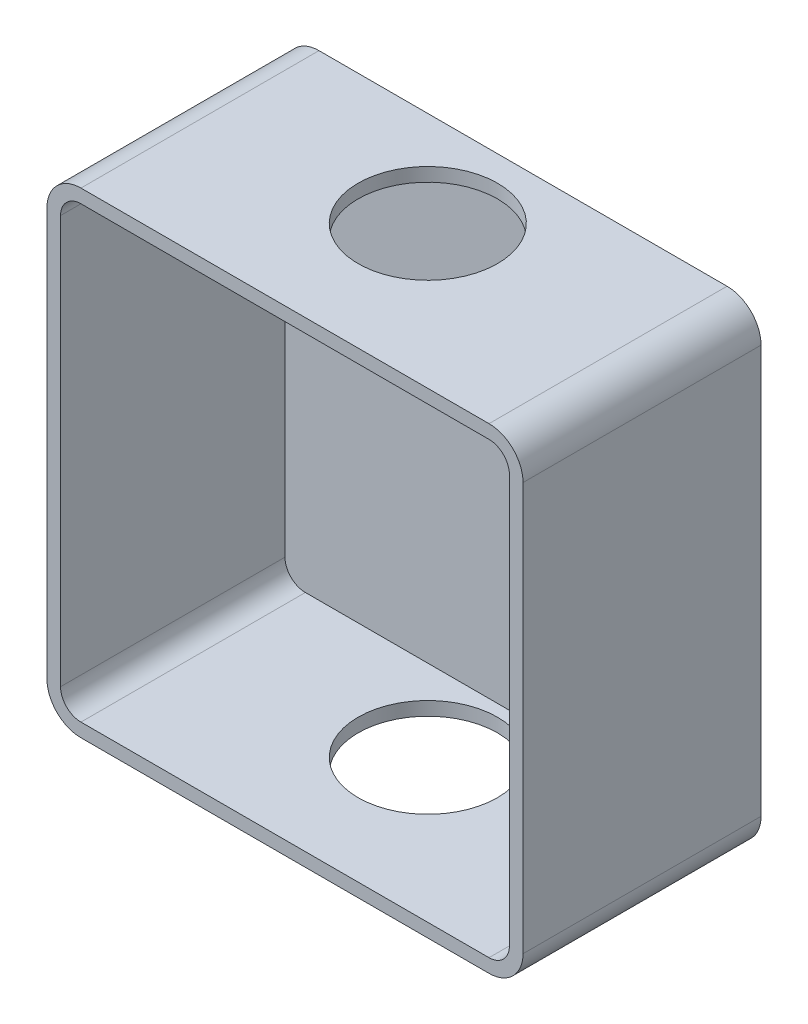
ISO-10303-21;
HEADER;
FILE_DESCRIPTION(('STEP AP214'),'2;1');
FILE_NAME('part.step','',(''),(''),'','','');
FILE_SCHEMA(('AUTOMOTIVE_DESIGN { 1 0 10303 214 1 1 1 1 }'));
ENDSEC;
DATA;
#1=APPLICATION_CONTEXT('core data for automotive mechanical design processes');
#2=APPLICATION_PROTOCOL_DEFINITION('international standard','automotive_design',2000,#1);
#3=PRODUCT_CONTEXT('',#1,'mechanical');
#4=PRODUCT('Part','Part','',(#3));
#5=PRODUCT_RELATED_PRODUCT_CATEGORY('part','',(#4));
#6=PRODUCT_DEFINITION_FORMATION('','',#4);
#7=PRODUCT_DEFINITION_CONTEXT('part definition',#1,'design');
#8=PRODUCT_DEFINITION('design','',#6,#7);
#9=PRODUCT_DEFINITION_SHAPE('','',#8);
#10=(LENGTH_UNIT() NAMED_UNIT(*) SI_UNIT(.MILLI.,.METRE.));
#11=(NAMED_UNIT(*) PLANE_ANGLE_UNIT() SI_UNIT($,.RADIAN.));
#12=(NAMED_UNIT(*) SI_UNIT($,.STERADIAN.) SOLID_ANGLE_UNIT());
#13=UNCERTAINTY_MEASURE_WITH_UNIT(LENGTH_MEASURE(1.E-05),#10,'distance_accuracy_value','');
#14=(GEOMETRIC_REPRESENTATION_CONTEXT(3) GLOBAL_UNCERTAINTY_ASSIGNED_CONTEXT((#13)) GLOBAL_UNIT_ASSIGNED_CONTEXT((#10,
#11,#12)) REPRESENTATION_CONTEXT('',''));
#15=CARTESIAN_POINT('',(0.,0.,0.));
#16=DIRECTION('',(0.,0.,1.));
#17=DIRECTION('',(1.,0.,0.));
#18=AXIS2_PLACEMENT_3D('',#15,#16,#17);
#19=CARTESIAN_POINT('',(-30.,-30.,35.));
#20=DIRECTION('',(0.,0.,-1.));
#21=DIRECTION('',(-1.,0.,0.));
#22=AXIS2_PLACEMENT_3D('',#19,#20,#21);
#23=PLANE('',#22);
#24=CARTESIAN_POINT('',(-30.,-30.,35.));
#25=DIRECTION('',(0.,0.,1.));
#26=DIRECTION('',(-1.,0.,0.));
#27=AXIS2_PLACEMENT_3D('',#24,#25,#26);
#28=CIRCLE('',#27,5.);
#29=CARTESIAN_POINT('',(-35.,-30.,35.));
#30=VERTEX_POINT('',#29);
#31=CARTESIAN_POINT('',(-30.,-35.,35.));
#32=VERTEX_POINT('',#31);
#33=EDGE_CURVE('E162',#30,#32,#28,.T.);
#34=ORIENTED_EDGE('',*,*,#33,.T.);
#35=DIRECTION('',(1.,0.,0.));
#36=VECTOR('',#35,1.);
#37=CARTESIAN_POINT('',(-30.,-35.,35.));
#38=LINE('',#37,#36);
#39=CARTESIAN_POINT('',(30.,-35.,35.));
#40=VERTEX_POINT('',#39);
#41=EDGE_CURVE('E103',#32,#40,#38,.T.);
#42=ORIENTED_EDGE('',*,*,#41,.T.);
#43=CARTESIAN_POINT('',(30.,-30.,35.));
#44=DIRECTION('',(0.,0.,1.));
#45=DIRECTION('',(1.,0.,0.));
#46=AXIS2_PLACEMENT_3D('',#43,#44,#45);
#47=CIRCLE('',#46,5.);
#48=CARTESIAN_POINT('',(35.,-30.,35.));
#49=VERTEX_POINT('',#48);
#50=EDGE_CURVE('E178',#40,#49,#47,.T.);
#51=ORIENTED_EDGE('',*,*,#50,.T.);
#52=DIRECTION('',(0.,1.,0.));
#53=VECTOR('',#52,1.);
#54=CARTESIAN_POINT('',(35.,-30.,35.));
#55=LINE('',#54,#53);
#56=CARTESIAN_POINT('',(35.,30.,35.));
#57=VERTEX_POINT('',#56);
#58=EDGE_CURVE('E190',#49,#57,#55,.T.);
#59=ORIENTED_EDGE('',*,*,#58,.T.);
#60=CARTESIAN_POINT('',(30.,30.,35.));
#61=DIRECTION('',(0.,0.,1.));
#62=DIRECTION('',(-1.,0.,0.));
#63=AXIS2_PLACEMENT_3D('',#60,#61,#62);
#64=CIRCLE('',#63,5.);
#65=CARTESIAN_POINT('',(30.,35.,35.));
#66=VERTEX_POINT('',#65);
#67=EDGE_CURVE('E125',#57,#66,#64,.T.);
#68=ORIENTED_EDGE('',*,*,#67,.T.);
#69=DIRECTION('',(-1.,0.,0.));
#70=VECTOR('',#69,1.);
#71=CARTESIAN_POINT('',(-30.,35.,35.));
#72=LINE('',#71,#70);
#73=CARTESIAN_POINT('',(-30.,35.,35.));
#74=VERTEX_POINT('',#73);
#75=EDGE_CURVE('E118',#66,#74,#72,.T.);
#76=ORIENTED_EDGE('',*,*,#75,.T.);
#77=CARTESIAN_POINT('',(-30.,30.,35.));
#78=DIRECTION('',(0.,0.,1.));
#79=DIRECTION('',(-1.,0.,0.));
#80=AXIS2_PLACEMENT_3D('',#77,#78,#79);
#81=CIRCLE('',#80,5.);
#82=CARTESIAN_POINT('',(-35.,30.,35.));
#83=VERTEX_POINT('',#82);
#84=EDGE_CURVE('E122',#74,#83,#81,.T.);
#85=ORIENTED_EDGE('',*,*,#84,.T.);
#86=DIRECTION('',(0.,-1.,0.));
#87=VECTOR('',#86,1.);
#88=CARTESIAN_POINT('',(-35.,-30.,35.));
#89=LINE('',#88,#87);
#90=EDGE_CURVE('E62',#83,#30,#89,.T.);
#91=ORIENTED_EDGE('',*,*,#90,.T.);
#92=EDGE_LOOP('',(#34,#42,#51,#59,#68,#76,#85,#91));
#93=FACE_BOUND('',#92,.T.);
#94=CARTESIAN_POINT('',(-30.,-30.,35.));
#95=DIRECTION('',(0.,0.,-1.));
#96=DIRECTION('',(-1.,0.,0.));
#97=AXIS2_PLACEMENT_3D('',#94,#95,#96);
#98=CIRCLE('',#97,3.);
#99=CARTESIAN_POINT('',(-33.,-30.,35.));
#100=VERTEX_POINT('',#99);
#101=CARTESIAN_POINT('',(-30.,-33.,35.));
#102=VERTEX_POINT('',#101);
#103=EDGE_CURVE('E216',#100,#102,#98,.F.);
#104=ORIENTED_EDGE('',*,*,#103,.F.);
#105=DIRECTION('',(0.,-1.,0.));
#106=VECTOR('',#105,1.);
#107=CARTESIAN_POINT('',(-33.,-30.,35.));
#108=LINE('',#107,#106);
#109=CARTESIAN_POINT('',(-33.,30.,35.));
#110=VERTEX_POINT('',#109);
#111=EDGE_CURVE('E196',#110,#100,#108,.T.);
#112=ORIENTED_EDGE('',*,*,#111,.F.);
#113=CARTESIAN_POINT('',(-30.,30.,35.));
#114=DIRECTION('',(0.,0.,-1.));
#115=DIRECTION('',(-1.,0.,0.));
#116=AXIS2_PLACEMENT_3D('',#113,#114,#115);
#117=CIRCLE('',#116,3.);
#118=CARTESIAN_POINT('',(-30.,33.,35.));
#119=VERTEX_POINT('',#118);
#120=EDGE_CURVE('E199',#119,#110,#117,.F.);
#121=ORIENTED_EDGE('',*,*,#120,.F.);
#122=DIRECTION('',(-1.,0.,0.));
#123=VECTOR('',#122,1.);
#124=CARTESIAN_POINT('',(-30.,33.,35.));
#125=LINE('',#124,#123);
#126=CARTESIAN_POINT('',(30.,33.,35.));
#127=VERTEX_POINT('',#126);
#128=EDGE_CURVE('E201',#127,#119,#125,.T.);
#129=ORIENTED_EDGE('',*,*,#128,.F.);
#130=CARTESIAN_POINT('',(30.,30.,35.));
#131=DIRECTION('',(0.,0.,-1.));
#132=DIRECTION('',(-1.,0.,0.));
#133=AXIS2_PLACEMENT_3D('',#130,#131,#132);
#134=CIRCLE('',#133,3.);
#135=CARTESIAN_POINT('',(33.,30.,35.));
#136=VERTEX_POINT('',#135);
#137=EDGE_CURVE('E204',#136,#127,#134,.F.);
#138=ORIENTED_EDGE('',*,*,#137,.F.);
#139=DIRECTION('',(0.,1.,0.));
#140=VECTOR('',#139,1.);
#141=CARTESIAN_POINT('',(33.,-30.,35.));
#142=LINE('',#141,#140);
#143=CARTESIAN_POINT('',(33.,-30.,35.));
#144=VERTEX_POINT('',#143);
#145=EDGE_CURVE('E207',#144,#136,#142,.T.);
#146=ORIENTED_EDGE('',*,*,#145,.F.);
#147=CARTESIAN_POINT('',(30.,-30.,35.));
#148=DIRECTION('',(0.,0.,-1.));
#149=DIRECTION('',(-1.,0.,0.));
#150=AXIS2_PLACEMENT_3D('',#147,#148,#149);
#151=CIRCLE('',#150,3.);
#152=CARTESIAN_POINT('',(30.,-33.,35.));
#153=VERTEX_POINT('',#152);
#154=EDGE_CURVE('E210',#153,#144,#151,.F.);
#155=ORIENTED_EDGE('',*,*,#154,.F.);
#156=DIRECTION('',(1.,0.,0.));
#157=VECTOR('',#156,1.);
#158=CARTESIAN_POINT('',(-30.,-33.,35.));
#159=LINE('',#158,#157);
#160=EDGE_CURVE('E213',#102,#153,#159,.T.);
#161=ORIENTED_EDGE('',*,*,#160,.F.);
#162=EDGE_LOOP('',(#104,#112,#121,#129,#138,#146,#155,#161));
#163=FACE_BOUND('',#162,.T.);
#164=ADVANCED_FACE('F37',(#93,#163),#23,.F.);
#165=CARTESIAN_POINT('',(-30.,-30.,35.));
#166=DIRECTION('',(0.,0.,-1.));
#167=DIRECTION('',(-1.,0.,0.));
#168=AXIS2_PLACEMENT_3D('',#165,#166,#167);
#169=CYLINDRICAL_SURFACE('',#168,5.);
#170=CARTESIAN_POINT('',(-30.,-30.,0.));
#171=DIRECTION('',(0.,0.,1.));
#172=DIRECTION('',(-1.,0.,0.));
#173=AXIS2_PLACEMENT_3D('',#170,#171,#172);
#174=CIRCLE('',#173,5.);
#175=CARTESIAN_POINT('',(-35.,-30.,0.));
#176=VERTEX_POINT('',#175);
#177=CARTESIAN_POINT('',(-30.,-35.,0.));
#178=VERTEX_POINT('',#177);
#179=EDGE_CURVE('E146',#176,#178,#174,.T.);
#180=ORIENTED_EDGE('',*,*,#179,.T.);
#181=DIRECTION('',(0.,0.,-1.));
#182=VECTOR('',#181,1.);
#183=CARTESIAN_POINT('',(-30.,-35.,35.));
#184=LINE('',#183,#182);
#185=EDGE_CURVE('E11',#32,#178,#184,.T.);
#186=ORIENTED_EDGE('',*,*,#185,.F.);
#187=ORIENTED_EDGE('',*,*,#33,.F.);
#188=DIRECTION('',(0.,0.,-1.));
#189=VECTOR('',#188,1.);
#190=CARTESIAN_POINT('',(-35.,-30.,35.));
#191=LINE('',#190,#189);
#192=EDGE_CURVE('E142',#30,#176,#191,.T.);
#193=ORIENTED_EDGE('',*,*,#192,.T.);
#194=EDGE_LOOP('',(#180,#186,#187,#193));
#195=FACE_BOUND('',#194,.T.);
#196=ADVANCED_FACE('F39',(#195),#169,.T.);
#197=CARTESIAN_POINT('',(-30.,-35.,35.));
#198=DIRECTION('',(0.,1.,0.));
#199=DIRECTION('',(0.,0.,1.));
#200=AXIS2_PLACEMENT_3D('',#197,#198,#199);
#201=PLANE('',#200);
#202=CARTESIAN_POINT('',(0.,-35.,14.));
#203=DIRECTION('',(0.,-1.,0.));
#204=DIRECTION('',(0.,0.,-1.));
#205=AXIS2_PLACEMENT_3D('',#202,#203,#204);
#206=CIRCLE('',#205,10.25);
#207=CARTESIAN_POINT('',(0.,-35.,3.75));
#208=VERTEX_POINT('',#207);
#209=EDGE_CURVE('E266',#208,#208,#206,.T.);
#210=ORIENTED_EDGE('',*,*,#209,.F.);
#211=EDGE_LOOP('',(#210));
#212=FACE_BOUND('',#211,.T.);
#213=DIRECTION('',(1.,0.,0.));
#214=VECTOR('',#213,1.);
#215=CARTESIAN_POINT('',(-30.,-35.,0.));
#216=LINE('',#215,#214);
#217=CARTESIAN_POINT('',(30.,-35.,0.));
#218=VERTEX_POINT('',#217);
#219=EDGE_CURVE('E149',#178,#218,#216,.T.);
#220=ORIENTED_EDGE('',*,*,#219,.T.);
#221=DIRECTION('',(0.,0.,-1.));
#222=VECTOR('',#221,1.);
#223=CARTESIAN_POINT('',(30.,-35.,35.));
#224=LINE('',#223,#222);
#225=EDGE_CURVE('E46',#40,#218,#224,.T.);
#226=ORIENTED_EDGE('',*,*,#225,.F.);
#227=ORIENTED_EDGE('',*,*,#41,.F.);
#228=ORIENTED_EDGE('',*,*,#185,.T.);
#229=EDGE_LOOP('',(#220,#226,#227,#228));
#230=FACE_BOUND('',#229,.T.);
#231=ADVANCED_FACE('F358',(#212,#230),#201,.F.);
#232=CARTESIAN_POINT('',(30.,-30.,35.));
#233=DIRECTION('',(0.,0.,-1.));
#234=DIRECTION('',(-1.,0.,0.));
#235=AXIS2_PLACEMENT_3D('',#232,#233,#234);
#236=CYLINDRICAL_SURFACE('',#235,5.);
#237=CARTESIAN_POINT('',(30.,-30.,0.));
#238=DIRECTION('',(0.,0.,1.));
#239=DIRECTION('',(1.,0.,0.));
#240=AXIS2_PLACEMENT_3D('',#237,#238,#239);
#241=CIRCLE('',#240,5.);
#242=CARTESIAN_POINT('',(35.,-30.,0.));
#243=VERTEX_POINT('',#242);
#244=EDGE_CURVE('E152',#218,#243,#241,.T.);
#245=ORIENTED_EDGE('',*,*,#244,.T.);
#246=DIRECTION('',(0.,0.,-1.));
#247=VECTOR('',#246,1.);
#248=CARTESIAN_POINT('',(35.,-30.,35.));
#249=LINE('',#248,#247);
#250=EDGE_CURVE('E169',#49,#243,#249,.T.);
#251=ORIENTED_EDGE('',*,*,#250,.F.);
#252=ORIENTED_EDGE('',*,*,#50,.F.);
#253=ORIENTED_EDGE('',*,*,#225,.T.);
#254=EDGE_LOOP('',(#245,#251,#252,#253));
#255=FACE_BOUND('',#254,.T.);
#256=ADVANCED_FACE('F176',(#255),#236,.T.);
#257=CARTESIAN_POINT('',(35.,-30.,35.));
#258=DIRECTION('',(-1.,0.,0.));
#259=DIRECTION('',(0.,0.,1.));
#260=AXIS2_PLACEMENT_3D('',#257,#258,#259);
#261=PLANE('',#260);
#262=DIRECTION('',(0.,1.,0.));
#263=VECTOR('',#262,1.);
#264=CARTESIAN_POINT('',(35.,-30.,0.));
#265=LINE('',#264,#263);
#266=CARTESIAN_POINT('',(35.,30.,0.));
#267=VERTEX_POINT('',#266);
#268=EDGE_CURVE('E154',#243,#267,#265,.T.);
#269=ORIENTED_EDGE('',*,*,#268,.T.);
#270=DIRECTION('',(0.,0.,-1.));
#271=VECTOR('',#270,1.);
#272=CARTESIAN_POINT('',(35.,30.,35.));
#273=LINE('',#272,#271);
#274=EDGE_CURVE('E166',#57,#267,#273,.T.);
#275=ORIENTED_EDGE('',*,*,#274,.F.);
#276=ORIENTED_EDGE('',*,*,#58,.F.);
#277=ORIENTED_EDGE('',*,*,#250,.T.);
#278=EDGE_LOOP('',(#269,#275,#276,#277));
#279=FACE_BOUND('',#278,.T.);
#280=ADVANCED_FACE('F186',(#279),#261,.F.);
#281=CARTESIAN_POINT('',(30.,30.,35.));
#282=DIRECTION('',(0.,0.,-1.));
#283=DIRECTION('',(-1.,0.,0.));
#284=AXIS2_PLACEMENT_3D('',#281,#282,#283);
#285=CYLINDRICAL_SURFACE('',#284,5.);
#286=CARTESIAN_POINT('',(30.,30.,0.));
#287=DIRECTION('',(0.,0.,1.));
#288=DIRECTION('',(-1.,0.,0.));
#289=AXIS2_PLACEMENT_3D('',#286,#287,#288);
#290=CIRCLE('',#289,5.);
#291=CARTESIAN_POINT('',(30.,35.,0.));
#292=VERTEX_POINT('',#291);
#293=EDGE_CURVE('E156',#267,#292,#290,.T.);
#294=ORIENTED_EDGE('',*,*,#293,.T.);
#295=DIRECTION('',(0.,0.,-1.));
#296=VECTOR('',#295,1.);
#297=CARTESIAN_POINT('',(30.,35.,35.));
#298=LINE('',#297,#296);
#299=EDGE_CURVE('E137',#66,#292,#298,.T.);
#300=ORIENTED_EDGE('',*,*,#299,.F.);
#301=ORIENTED_EDGE('',*,*,#67,.F.);
#302=ORIENTED_EDGE('',*,*,#274,.T.);
#303=EDGE_LOOP('',(#294,#300,#301,#302));
#304=FACE_BOUND('',#303,.T.);
#305=ADVANCED_FACE('F189',(#304),#285,.T.);
#306=CARTESIAN_POINT('',(-30.,35.,35.));
#307=DIRECTION('',(0.,-1.,0.));
#308=DIRECTION('',(0.,0.,-1.));
#309=AXIS2_PLACEMENT_3D('',#306,#307,#308);
#310=PLANE('',#309);
#311=CARTESIAN_POINT('',(0.,35.,14.));
#312=DIRECTION('',(0.,-1.,0.));
#313=DIRECTION('',(0.,0.,-1.));
#314=AXIS2_PLACEMENT_3D('',#311,#312,#313);
#315=CIRCLE('',#314,10.25);
#316=CARTESIAN_POINT('',(0.,35.,3.75));
#317=VERTEX_POINT('',#316);
#318=EDGE_CURVE('E269',#317,#317,#315,.T.);
#319=ORIENTED_EDGE('',*,*,#318,.T.);
#320=EDGE_LOOP('',(#319));
#321=FACE_BOUND('',#320,.T.);
#322=DIRECTION('',(-1.,0.,0.));
#323=VECTOR('',#322,1.);
#324=CARTESIAN_POINT('',(-30.,35.,0.));
#325=LINE('',#324,#323);
#326=CARTESIAN_POINT('',(-30.,35.,0.));
#327=VERTEX_POINT('',#326);
#328=EDGE_CURVE('E134',#292,#327,#325,.T.);
#329=ORIENTED_EDGE('',*,*,#328,.T.);
#330=DIRECTION('',(0.,0.,-1.));
#331=VECTOR('',#330,1.);
#332=CARTESIAN_POINT('',(-30.,35.,35.));
#333=LINE('',#332,#331);
#334=EDGE_CURVE('E131',#74,#327,#333,.T.);
#335=ORIENTED_EDGE('',*,*,#334,.F.);
#336=ORIENTED_EDGE('',*,*,#75,.F.);
#337=ORIENTED_EDGE('',*,*,#299,.T.);
#338=EDGE_LOOP('',(#329,#335,#336,#337));
#339=FACE_BOUND('',#338,.T.);
#340=ADVANCED_FACE('F132',(#321,#339),#310,.F.);
#341=CARTESIAN_POINT('',(-30.,30.,35.));
#342=DIRECTION('',(0.,0.,-1.));
#343=DIRECTION('',(-1.,0.,0.));
#344=AXIS2_PLACEMENT_3D('',#341,#342,#343);
#345=CYLINDRICAL_SURFACE('',#344,5.);
#346=CARTESIAN_POINT('',(-30.,30.,0.));
#347=DIRECTION('',(0.,0.,1.));
#348=DIRECTION('',(-1.,0.,0.));
#349=AXIS2_PLACEMENT_3D('',#346,#347,#348);
#350=CIRCLE('',#349,5.);
#351=CARTESIAN_POINT('',(-35.,30.,0.));
#352=VERTEX_POINT('',#351);
#353=EDGE_CURVE('E159',#327,#352,#350,.T.);
#354=ORIENTED_EDGE('',*,*,#353,.T.);
#355=DIRECTION('',(0.,0.,-1.));
#356=VECTOR('',#355,1.);
#357=CARTESIAN_POINT('',(-35.,30.,35.));
#358=LINE('',#357,#356);
#359=EDGE_CURVE('E138',#83,#352,#358,.T.);
#360=ORIENTED_EDGE('',*,*,#359,.F.);
#361=ORIENTED_EDGE('',*,*,#84,.F.);
#362=ORIENTED_EDGE('',*,*,#334,.T.);
#363=EDGE_LOOP('',(#354,#360,#361,#362));
#364=FACE_BOUND('',#363,.T.);
#365=ADVANCED_FACE('F140',(#364),#345,.T.);
#366=CARTESIAN_POINT('',(-35.,-30.,35.));
#367=DIRECTION('',(1.,0.,0.));
#368=DIRECTION('',(0.,0.,-1.));
#369=AXIS2_PLACEMENT_3D('',#366,#367,#368);
#370=PLANE('',#369);
#371=DIRECTION('',(0.,-1.,0.));
#372=VECTOR('',#371,1.);
#373=CARTESIAN_POINT('',(-35.,-30.,0.));
#374=LINE('',#373,#372);
#375=EDGE_CURVE('E95',#352,#176,#374,.T.);
#376=ORIENTED_EDGE('',*,*,#375,.T.);
#377=ORIENTED_EDGE('',*,*,#192,.F.);
#378=ORIENTED_EDGE('',*,*,#90,.F.);
#379=ORIENTED_EDGE('',*,*,#359,.T.);
#380=EDGE_LOOP('',(#376,#377,#378,#379));
#381=FACE_BOUND('',#380,.T.);
#382=ADVANCED_FACE('F364',(#381),#370,.F.);
#383=CARTESIAN_POINT('',(-30.,-30.,0.));
#384=DIRECTION('',(0.,0.,-1.));
#385=DIRECTION('',(-1.,0.,0.));
#386=AXIS2_PLACEMENT_3D('',#383,#384,#385);
#387=PLANE('',#386);
#388=ORIENTED_EDGE('',*,*,#179,.F.);
#389=ORIENTED_EDGE('',*,*,#375,.F.);
#390=ORIENTED_EDGE('',*,*,#353,.F.);
#391=ORIENTED_EDGE('',*,*,#328,.F.);
#392=ORIENTED_EDGE('',*,*,#293,.F.);
#393=ORIENTED_EDGE('',*,*,#268,.F.);
#394=ORIENTED_EDGE('',*,*,#244,.F.);
#395=ORIENTED_EDGE('',*,*,#219,.F.);
#396=EDGE_LOOP('',(#388,#389,#390,#391,#392,#393,#394,#395));
#397=FACE_BOUND('',#396,.T.);
#398=ADVANCED_FACE('F182',(#397),#387,.T.);
#399=CARTESIAN_POINT('',(-30.,-30.,35.));
#400=DIRECTION('',(0.,0.,-1.));
#401=DIRECTION('',(-1.,0.,0.));
#402=AXIS2_PLACEMENT_3D('',#399,#400,#401);
#403=CYLINDRICAL_SURFACE('',#402,3.);
#404=CARTESIAN_POINT('',(-30.,-30.,2.));
#405=DIRECTION('',(0.,0.,-1.));
#406=DIRECTION('',(-1.,0.,0.));
#407=AXIS2_PLACEMENT_3D('',#404,#405,#406);
#408=CIRCLE('',#407,3.);
#409=CARTESIAN_POINT('',(-33.,-30.,2.));
#410=VERTEX_POINT('',#409);
#411=CARTESIAN_POINT('',(-30.,-33.,2.));
#412=VERTEX_POINT('',#411);
#413=EDGE_CURVE('E256',#410,#412,#408,.F.);
#414=ORIENTED_EDGE('',*,*,#413,.F.);
#415=DIRECTION('',(0.,0.,-1.));
#416=VECTOR('',#415,1.);
#417=CARTESIAN_POINT('',(-33.,-30.,35.));
#418=LINE('',#417,#416);
#419=EDGE_CURVE('E198',#100,#410,#418,.T.);
#420=ORIENTED_EDGE('',*,*,#419,.F.);
#421=ORIENTED_EDGE('',*,*,#103,.T.);
#422=DIRECTION('',(0.,0.,1.));
#423=VECTOR('',#422,1.);
#424=CARTESIAN_POINT('',(-30.,-33.,35.));
#425=LINE('',#424,#423);
#426=EDGE_CURVE('E150',#102,#412,#425,.F.);
#427=ORIENTED_EDGE('',*,*,#426,.T.);
#428=EDGE_LOOP('',(#414,#420,#421,#427));
#429=FACE_BOUND('',#428,.T.);
#430=ADVANCED_FACE('F321',(#429),#403,.F.);
#431=CARTESIAN_POINT('',(-30.,-33.,35.));
#432=DIRECTION('',(0.,1.,0.));
#433=DIRECTION('',(0.,0.,1.));
#434=AXIS2_PLACEMENT_3D('',#431,#432,#433);
#435=PLANE('',#434);
#436=CARTESIAN_POINT('',(0.,-33.,14.));
#437=DIRECTION('',(0.,1.,0.));
#438=DIRECTION('',(0.,0.,1.));
#439=AXIS2_PLACEMENT_3D('',#436,#437,#438);
#440=CIRCLE('',#439,10.25);
#441=CARTESIAN_POINT('',(0.,-33.,24.25));
#442=VERTEX_POINT('',#441);
#443=EDGE_CURVE('E263',#442,#442,#440,.T.);
#444=ORIENTED_EDGE('',*,*,#443,.F.);
#445=EDGE_LOOP('',(#444));
#446=FACE_BOUND('',#445,.T.);
#447=DIRECTION('',(1.,0.,0.));
#448=VECTOR('',#447,1.);
#449=CARTESIAN_POINT('',(-30.,-33.,2.));
#450=LINE('',#449,#448);
#451=CARTESIAN_POINT('',(30.,-33.,2.));
#452=VERTEX_POINT('',#451);
#453=EDGE_CURVE('E251',#412,#452,#450,.T.);
#454=ORIENTED_EDGE('',*,*,#453,.F.);
#455=ORIENTED_EDGE('',*,*,#426,.F.);
#456=ORIENTED_EDGE('',*,*,#160,.T.);
#457=DIRECTION('',(0.,0.,-1.));
#458=VECTOR('',#457,1.);
#459=CARTESIAN_POINT('',(30.,-33.,35.));
#460=LINE('',#459,#458);
#461=EDGE_CURVE('E248',#153,#452,#460,.T.);
#462=ORIENTED_EDGE('',*,*,#461,.T.);
#463=EDGE_LOOP('',(#454,#455,#456,#462));
#464=FACE_BOUND('',#463,.T.);
#465=ADVANCED_FACE('F329',(#446,#464),#435,.T.);
#466=CARTESIAN_POINT('',(30.,-30.,35.));
#467=DIRECTION('',(0.,0.,-1.));
#468=DIRECTION('',(-1.,0.,0.));
#469=AXIS2_PLACEMENT_3D('',#466,#467,#468);
#470=CYLINDRICAL_SURFACE('',#469,3.);
#471=CARTESIAN_POINT('',(30.,-30.,2.));
#472=DIRECTION('',(0.,0.,-1.));
#473=DIRECTION('',(-1.,0.,0.));
#474=AXIS2_PLACEMENT_3D('',#471,#472,#473);
#475=CIRCLE('',#474,3.);
#476=CARTESIAN_POINT('',(33.,-30.,2.));
#477=VERTEX_POINT('',#476);
#478=EDGE_CURVE('E245',#452,#477,#475,.F.);
#479=ORIENTED_EDGE('',*,*,#478,.F.);
#480=ORIENTED_EDGE('',*,*,#461,.F.);
#481=ORIENTED_EDGE('',*,*,#154,.T.);
#482=DIRECTION('',(0.,0.,1.));
#483=VECTOR('',#482,1.);
#484=CARTESIAN_POINT('',(33.,-30.,35.));
#485=LINE('',#484,#483);
#486=EDGE_CURVE('E242',#144,#477,#485,.F.);
#487=ORIENTED_EDGE('',*,*,#486,.T.);
#488=EDGE_LOOP('',(#479,#480,#481,#487));
#489=FACE_BOUND('',#488,.T.);
#490=ADVANCED_FACE('F333',(#489),#470,.F.);
#491=CARTESIAN_POINT('',(33.,-30.,35.));
#492=DIRECTION('',(-1.,0.,0.));
#493=DIRECTION('',(0.,0.,1.));
#494=AXIS2_PLACEMENT_3D('',#491,#492,#493);
#495=PLANE('',#494);
#496=DIRECTION('',(0.,1.,0.));
#497=VECTOR('',#496,1.);
#498=CARTESIAN_POINT('',(33.,-30.,2.));
#499=LINE('',#498,#497);
#500=CARTESIAN_POINT('',(33.,30.,2.));
#501=VERTEX_POINT('',#500);
#502=EDGE_CURVE('E239',#477,#501,#499,.T.);
#503=ORIENTED_EDGE('',*,*,#502,.F.);
#504=ORIENTED_EDGE('',*,*,#486,.F.);
#505=ORIENTED_EDGE('',*,*,#145,.T.);
#506=DIRECTION('',(0.,0.,-1.));
#507=VECTOR('',#506,1.);
#508=CARTESIAN_POINT('',(33.,30.,35.));
#509=LINE('',#508,#507);
#510=EDGE_CURVE('E236',#136,#501,#509,.T.);
#511=ORIENTED_EDGE('',*,*,#510,.T.);
#512=EDGE_LOOP('',(#503,#504,#505,#511));
#513=FACE_BOUND('',#512,.T.);
#514=ADVANCED_FACE('F343',(#513),#495,.T.);
#515=CARTESIAN_POINT('',(30.,30.,35.));
#516=DIRECTION('',(0.,0.,-1.));
#517=DIRECTION('',(-1.,0.,0.));
#518=AXIS2_PLACEMENT_3D('',#515,#516,#517);
#519=CYLINDRICAL_SURFACE('',#518,3.);
#520=CARTESIAN_POINT('',(30.,30.,2.));
#521=DIRECTION('',(0.,0.,-1.));
#522=DIRECTION('',(-1.,0.,0.));
#523=AXIS2_PLACEMENT_3D('',#520,#521,#522);
#524=CIRCLE('',#523,3.);
#525=CARTESIAN_POINT('',(30.,33.,2.));
#526=VERTEX_POINT('',#525);
#527=EDGE_CURVE('E233',#501,#526,#524,.F.);
#528=ORIENTED_EDGE('',*,*,#527,.F.);
#529=ORIENTED_EDGE('',*,*,#510,.F.);
#530=ORIENTED_EDGE('',*,*,#137,.T.);
#531=DIRECTION('',(0.,0.,-1.));
#532=VECTOR('',#531,1.);
#533=CARTESIAN_POINT('',(30.,33.,35.));
#534=LINE('',#533,#532);
#535=EDGE_CURVE('E230',#127,#526,#534,.T.);
#536=ORIENTED_EDGE('',*,*,#535,.T.);
#537=EDGE_LOOP('',(#528,#529,#530,#536));
#538=FACE_BOUND('',#537,.T.);
#539=ADVANCED_FACE('F283',(#538),#519,.F.);
#540=CARTESIAN_POINT('',(-30.,33.,35.));
#541=DIRECTION('',(0.,-1.,0.));
#542=DIRECTION('',(0.,0.,-1.));
#543=AXIS2_PLACEMENT_3D('',#540,#541,#542);
#544=PLANE('',#543);
#545=CARTESIAN_POINT('',(0.,33.,14.));
#546=DIRECTION('',(0.,-1.,0.));
#547=DIRECTION('',(0.,0.,-1.));
#548=AXIS2_PLACEMENT_3D('',#545,#546,#547);
#549=CIRCLE('',#548,10.25);
#550=CARTESIAN_POINT('',(0.,33.,3.75));
#551=VERTEX_POINT('',#550);
#552=EDGE_CURVE('E41',#551,#551,#549,.T.);
#553=ORIENTED_EDGE('',*,*,#552,.F.);
#554=EDGE_LOOP('',(#553));
#555=FACE_BOUND('',#554,.T.);
#556=DIRECTION('',(-1.,0.,0.));
#557=VECTOR('',#556,1.);
#558=CARTESIAN_POINT('',(-30.,33.,2.));
#559=LINE('',#558,#557);
#560=CARTESIAN_POINT('',(-30.,33.,2.));
#561=VERTEX_POINT('',#560);
#562=EDGE_CURVE('E227',#526,#561,#559,.T.);
#563=ORIENTED_EDGE('',*,*,#562,.F.);
#564=ORIENTED_EDGE('',*,*,#535,.F.);
#565=ORIENTED_EDGE('',*,*,#128,.T.);
#566=DIRECTION('',(0.,0.,-1.));
#567=VECTOR('',#566,1.);
#568=CARTESIAN_POINT('',(-30.,33.,35.));
#569=LINE('',#568,#567);
#570=EDGE_CURVE('E224',#119,#561,#569,.T.);
#571=ORIENTED_EDGE('',*,*,#570,.T.);
#572=EDGE_LOOP('',(#563,#564,#565,#571));
#573=FACE_BOUND('',#572,.T.);
#574=ADVANCED_FACE('F279',(#555,#573),#544,.T.);
#575=CARTESIAN_POINT('',(-30.,30.,35.));
#576=DIRECTION('',(0.,0.,-1.));
#577=DIRECTION('',(-1.,0.,0.));
#578=AXIS2_PLACEMENT_3D('',#575,#576,#577);
#579=CYLINDRICAL_SURFACE('',#578,3.);
#580=CARTESIAN_POINT('',(-30.,30.,2.));
#581=DIRECTION('',(0.,0.,-1.));
#582=DIRECTION('',(-1.,0.,0.));
#583=AXIS2_PLACEMENT_3D('',#580,#581,#582);
#584=CIRCLE('',#583,3.);
#585=CARTESIAN_POINT('',(-33.,30.,2.));
#586=VERTEX_POINT('',#585);
#587=EDGE_CURVE('E222',#561,#586,#584,.F.);
#588=ORIENTED_EDGE('',*,*,#587,.F.);
#589=ORIENTED_EDGE('',*,*,#570,.F.);
#590=ORIENTED_EDGE('',*,*,#120,.T.);
#591=DIRECTION('',(0.,0.,-1.));
#592=VECTOR('',#591,1.);
#593=CARTESIAN_POINT('',(-33.,30.,35.));
#594=LINE('',#593,#592);
#595=EDGE_CURVE('E53',#110,#586,#594,.T.);
#596=ORIENTED_EDGE('',*,*,#595,.T.);
#597=EDGE_LOOP('',(#588,#589,#590,#596));
#598=FACE_BOUND('',#597,.T.);
#599=ADVANCED_FACE('F282',(#598),#579,.F.);
#600=CARTESIAN_POINT('',(-33.,-30.,35.));
#601=DIRECTION('',(1.,0.,0.));
#602=DIRECTION('',(0.,0.,-1.));
#603=AXIS2_PLACEMENT_3D('',#600,#601,#602);
#604=PLANE('',#603);
#605=DIRECTION('',(0.,-1.,0.));
#606=VECTOR('',#605,1.);
#607=CARTESIAN_POINT('',(-33.,-30.,2.));
#608=LINE('',#607,#606);
#609=EDGE_CURVE('E219',#586,#410,#608,.T.);
#610=ORIENTED_EDGE('',*,*,#609,.F.);
#611=ORIENTED_EDGE('',*,*,#595,.F.);
#612=ORIENTED_EDGE('',*,*,#111,.T.);
#613=ORIENTED_EDGE('',*,*,#419,.T.);
#614=EDGE_LOOP('',(#610,#611,#612,#613));
#615=FACE_BOUND('',#614,.T.);
#616=ADVANCED_FACE('F316',(#615),#604,.T.);
#617=CARTESIAN_POINT('',(-30.,-30.,2.));
#618=DIRECTION('',(0.,0.,-1.));
#619=DIRECTION('',(-1.,0.,0.));
#620=AXIS2_PLACEMENT_3D('',#617,#618,#619);
#621=PLANE('',#620);
#622=ORIENTED_EDGE('',*,*,#413,.T.);
#623=ORIENTED_EDGE('',*,*,#453,.T.);
#624=ORIENTED_EDGE('',*,*,#478,.T.);
#625=ORIENTED_EDGE('',*,*,#502,.T.);
#626=ORIENTED_EDGE('',*,*,#527,.T.);
#627=ORIENTED_EDGE('',*,*,#562,.T.);
#628=ORIENTED_EDGE('',*,*,#587,.T.);
#629=ORIENTED_EDGE('',*,*,#609,.T.);
#630=EDGE_LOOP('',(#622,#623,#624,#625,#626,#627,#628,#629));
#631=FACE_BOUND('',#630,.T.);
#632=ADVANCED_FACE('F296',(#631),#621,.F.);
#633=CARTESIAN_POINT('',(0.,35.,14.));
#634=DIRECTION('',(0.,-1.,0.));
#635=DIRECTION('',(0.,0.,-1.));
#636=AXIS2_PLACEMENT_3D('',#633,#634,#635);
#637=CYLINDRICAL_SURFACE('',#636,10.25);
#638=ORIENTED_EDGE('',*,*,#552,.T.);
#639=EDGE_LOOP('',(#638));
#640=FACE_BOUND('',#639,.T.);
#641=ORIENTED_EDGE('',*,*,#318,.F.);
#642=EDGE_LOOP('',(#641));
#643=FACE_BOUND('',#642,.T.);
#644=ADVANCED_FACE('F276',(#640,#643),#637,.F.);
#645=ORIENTED_EDGE('',*,*,#443,.T.);
#646=EDGE_LOOP('',(#645));
#647=FACE_BOUND('',#646,.T.);
#648=ORIENTED_EDGE('',*,*,#209,.T.);
#649=EDGE_LOOP('',(#648));
#650=FACE_BOUND('',#649,.T.);
#651=ADVANCED_FACE('F384',(#647,#650),#637,.F.);
#652=CLOSED_SHELL('',(#164,#196,#231,#256,#280,#305,#340,#365,#382,#398,#430,#465,#490,#514,
#539,#574,#599,#616,#632,#644,#651));
#653=MANIFOLD_SOLID_BREP('B2',#652);
#654=ADVANCED_BREP_SHAPE_REPRESENTATION('',(#18,#653),#14);
#655=SHAPE_DEFINITION_REPRESENTATION(#9,#654);
ENDSEC;
END-ISO-10303-21;
